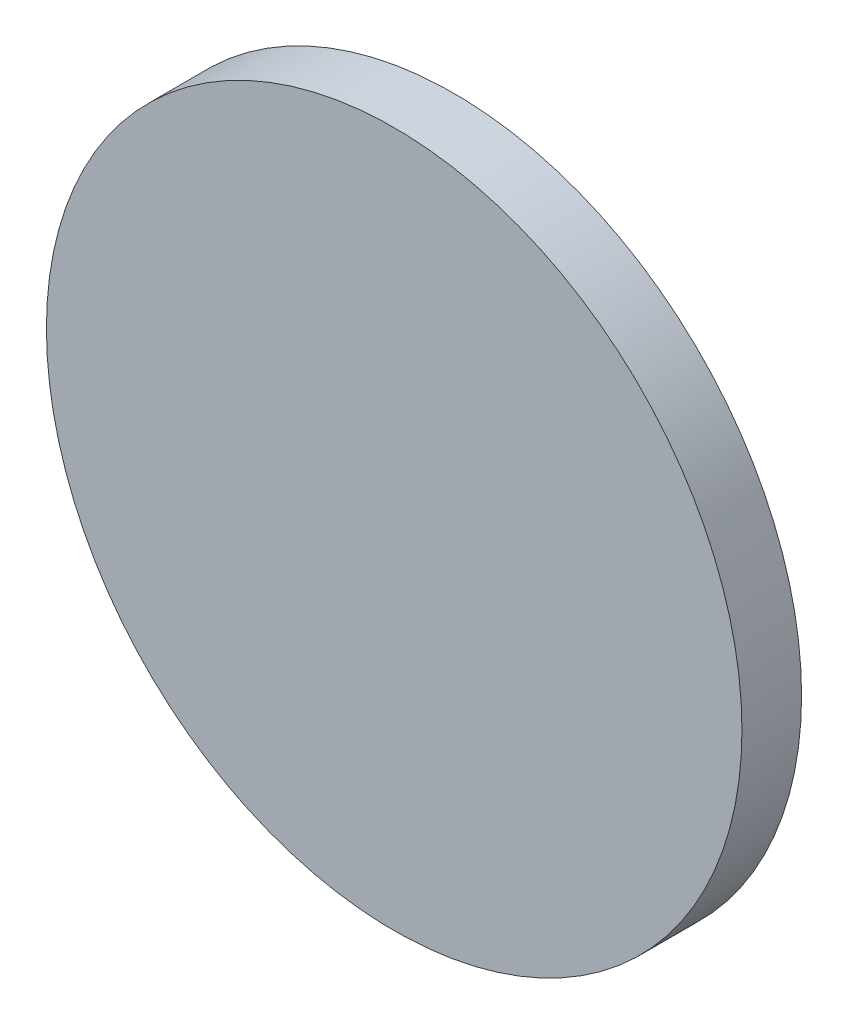
ISO-10303-21;
HEADER;
FILE_DESCRIPTION(('STEP AP214'),'2;1');
FILE_NAME('part.step','',(''),(''),'','','');
FILE_SCHEMA(('AUTOMOTIVE_DESIGN { 1 0 10303 214 1 1 1 1 }'));
ENDSEC;
DATA;
#1=APPLICATION_CONTEXT('core data for automotive mechanical design processes');
#2=APPLICATION_PROTOCOL_DEFINITION('international standard','automotive_design',2000,#1);
#3=PRODUCT_CONTEXT('',#1,'mechanical');
#4=PRODUCT('Part','Part','',(#3));
#5=PRODUCT_RELATED_PRODUCT_CATEGORY('part','',(#4));
#6=PRODUCT_DEFINITION_FORMATION('','',#4);
#7=PRODUCT_DEFINITION_CONTEXT('part definition',#1,'design');
#8=PRODUCT_DEFINITION('design','',#6,#7);
#9=PRODUCT_DEFINITION_SHAPE('','',#8);
#10=(LENGTH_UNIT() NAMED_UNIT(*) SI_UNIT(.MILLI.,.METRE.));
#11=(NAMED_UNIT(*) PLANE_ANGLE_UNIT() SI_UNIT($,.RADIAN.));
#12=(NAMED_UNIT(*) SI_UNIT($,.STERADIAN.) SOLID_ANGLE_UNIT());
#13=UNCERTAINTY_MEASURE_WITH_UNIT(LENGTH_MEASURE(1.E-05),#10,'distance_accuracy_value','');
#14=(GEOMETRIC_REPRESENTATION_CONTEXT(3) GLOBAL_UNCERTAINTY_ASSIGNED_CONTEXT((#13)) GLOBAL_UNIT_ASSIGNED_CONTEXT((#10,
#11,#12)) REPRESENTATION_CONTEXT('',''));
#15=CARTESIAN_POINT('',(0.,0.,0.));
#16=DIRECTION('',(0.,0.,1.));
#17=DIRECTION('',(1.,0.,0.));
#18=AXIS2_PLACEMENT_3D('',#15,#16,#17);
#19=CARTESIAN_POINT('',(5.3721,8.5979,0.03429));
#20=DIRECTION('',(0.,0.,1.));
#21=DIRECTION('',(1.,0.,0.));
#22=AXIS2_PLACEMENT_3D('',#19,#20,#21);
#23=PLANE('',#22);
#24=CARTESIAN_POINT('',(5.3721,8.5979,0.03429));
#25=DIRECTION('',(0.,0.,1.));
#26=DIRECTION('',(1.,0.,0.));
#27=AXIS2_PLACEMENT_3D('',#24,#25,#26);
#28=CIRCLE('',#27,0.200024667);
#29=CARTESIAN_POINT('',(5.572124667,8.5979,0.03429));
#30=VERTEX_POINT('',#29);
#31=EDGE_CURVE('E18',#30,#30,#28,.F.);
#32=ORIENTED_EDGE('',*,*,#31,.F.);
#33=EDGE_LOOP('',(#32));
#34=FACE_BOUND('',#33,.T.);
#35=ADVANCED_FACE('F15',(#34),#23,.T.);
#36=CARTESIAN_POINT('',(5.3721,8.5979,0.));
#37=DIRECTION('',(0.,0.,1.));
#38=DIRECTION('',(1.,0.,0.));
#39=AXIS2_PLACEMENT_3D('',#36,#37,#38);
#40=CYLINDRICAL_SURFACE('',#39,0.200024667);
#41=ORIENTED_EDGE('',*,*,#31,.T.);
#42=EDGE_LOOP('',(#41));
#43=FACE_BOUND('',#42,.T.);
#44=CARTESIAN_POINT('',(5.3721,8.5979,0.));
#45=DIRECTION('',(0.,0.,1.));
#46=DIRECTION('',(1.,0.,0.));
#47=AXIS2_PLACEMENT_3D('',#44,#45,#46);
#48=CIRCLE('',#47,0.200024667);
#49=CARTESIAN_POINT('',(5.572124667,8.5979,0.));
#50=VERTEX_POINT('',#49);
#51=EDGE_CURVE('E10',#50,#50,#48,.F.);
#52=ORIENTED_EDGE('',*,*,#51,.F.);
#53=EDGE_LOOP('',(#52));
#54=FACE_BOUND('',#53,.T.);
#55=ADVANCED_FACE('F27',(#43,#54),#40,.T.);
#56=CARTESIAN_POINT('',(5.3721,8.5979,0.));
#57=DIRECTION('',(0.,0.,-1.));
#58=DIRECTION('',(-1.,0.,0.));
#59=AXIS2_PLACEMENT_3D('',#56,#57,#58);
#60=PLANE('',#59);
#61=ORIENTED_EDGE('',*,*,#51,.T.);
#62=EDGE_LOOP('',(#61));
#63=FACE_BOUND('',#62,.T.);
#64=ADVANCED_FACE('F35',(#63),#60,.T.);
#65=CLOSED_SHELL('',(#35,#55,#64));
#66=MANIFOLD_SOLID_BREP('B1',#65);
#67=ADVANCED_BREP_SHAPE_REPRESENTATION('',(#18,#66),#14);
#68=SHAPE_DEFINITION_REPRESENTATION(#9,#67);
ENDSEC;
END-ISO-10303-21;
